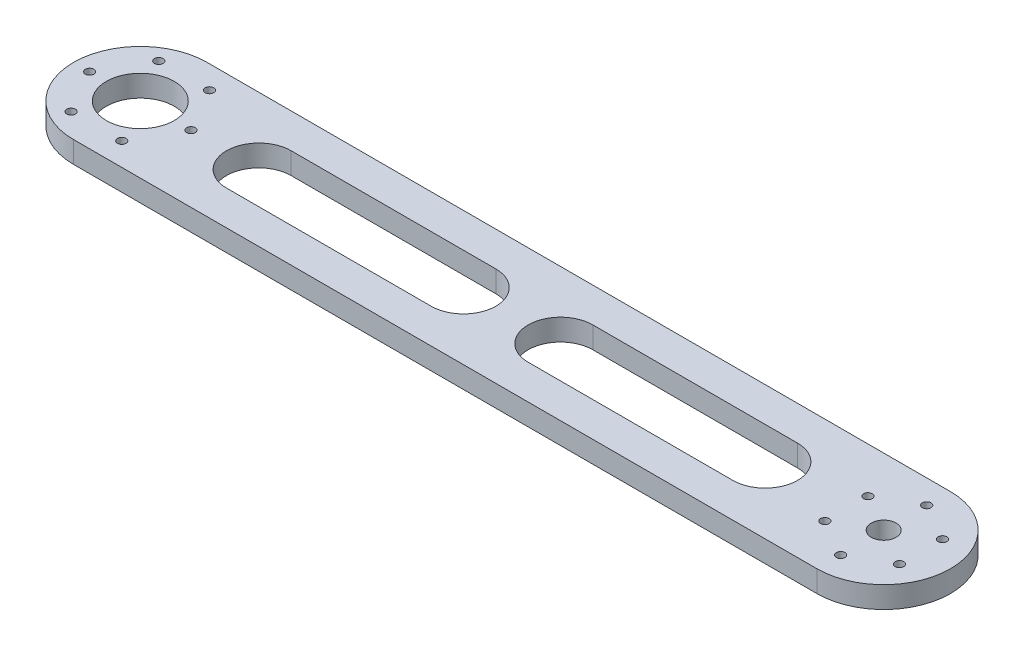
ISO-10303-21;
HEADER;
FILE_DESCRIPTION(('STEP AP214'),'2;1');
FILE_NAME('part.step','',(''),(''),'','','');
FILE_SCHEMA(('AUTOMOTIVE_DESIGN { 1 0 10303 214 1 1 1 1 }'));
ENDSEC;
DATA;
#1=APPLICATION_CONTEXT('core data for automotive mechanical design processes');
#2=APPLICATION_PROTOCOL_DEFINITION('international standard','automotive_design',2000,#1);
#3=PRODUCT_CONTEXT('',#1,'mechanical');
#4=PRODUCT('Part','Part','',(#3));
#5=PRODUCT_RELATED_PRODUCT_CATEGORY('part','',(#4));
#6=PRODUCT_DEFINITION_FORMATION('','',#4);
#7=PRODUCT_DEFINITION_CONTEXT('part definition',#1,'design');
#8=PRODUCT_DEFINITION('design','',#6,#7);
#9=PRODUCT_DEFINITION_SHAPE('','',#8);
#10=(LENGTH_UNIT() NAMED_UNIT(*) SI_UNIT(.MILLI.,.METRE.));
#11=(NAMED_UNIT(*) PLANE_ANGLE_UNIT() SI_UNIT($,.RADIAN.));
#12=(NAMED_UNIT(*) SI_UNIT($,.STERADIAN.) SOLID_ANGLE_UNIT());
#13=UNCERTAINTY_MEASURE_WITH_UNIT(LENGTH_MEASURE(1.E-05),#10,'distance_accuracy_value','');
#14=(GEOMETRIC_REPRESENTATION_CONTEXT(3) GLOBAL_UNCERTAINTY_ASSIGNED_CONTEXT((#13)) GLOBAL_UNIT_ASSIGNED_CONTEXT((#10,
#11,#12)) REPRESENTATION_CONTEXT('',''));
#15=CARTESIAN_POINT('',(0.,0.,0.));
#16=DIRECTION('',(0.,0.,1.));
#17=DIRECTION('',(1.,0.,0.));
#18=AXIS2_PLACEMENT_3D('',#15,#16,#17);
#19=CARTESIAN_POINT('',(-104.546683395043,10.,0.));
#20=DIRECTION('',(0.,1.,0.));
#21=DIRECTION('',(0.,0.,1.));
#22=AXIS2_PLACEMENT_3D('',#19,#20,#21);
#23=PLANE('',#22);
#24=CARTESIAN_POINT('',(-92.8085230633689,10.,20.3447613532394));
#25=DIRECTION('',(0.,1.,0.));
#26=DIRECTION('',(0.,0.,1.));
#27=AXIS2_PLACEMENT_3D('',#24,#25,#26);
#28=CIRCLE('',#27,1.99999999999998);
#29=CARTESIAN_POINT('',(-92.8085230633689,10.,22.3447613532394));
#30=VERTEX_POINT('',#29);
#31=EDGE_CURVE('E199',#30,#30,#28,.T.);
#32=ORIENTED_EDGE('',*,*,#31,.F.);
#33=EDGE_LOOP('',(#32));
#34=FACE_BOUND('',#33,.T.);
#35=CARTESIAN_POINT('',(-92.8085230633687,10.,-20.3447613532391));
#36=DIRECTION('',(0.,1.,0.));
#37=DIRECTION('',(0.,0.,1.));
#38=AXIS2_PLACEMENT_3D('',#35,#36,#37);
#39=CIRCLE('',#38,2.);
#40=CARTESIAN_POINT('',(-92.8085230633687,10.,-18.3447613532391));
#41=VERTEX_POINT('',#40);
#42=EDGE_CURVE('E211',#41,#41,#39,.T.);
#43=ORIENTED_EDGE('',*,*,#42,.F.);
#44=EDGE_LOOP('',(#43));
#45=FACE_BOUND('',#44,.T.);
#46=CARTESIAN_POINT('',(240.44542349274,10.,19.9863287286099));
#47=DIRECTION('',(0.,1.,0.));
#48=DIRECTION('',(0.,0.,1.));
#49=AXIS2_PLACEMENT_3D('',#46,#47,#48);
#50=CIRCLE('',#49,2.00000000000003);
#51=CARTESIAN_POINT('',(240.44542349274,10.,21.98632872861));
#52=VERTEX_POINT('',#51);
#53=EDGE_CURVE('E223',#52,#52,#50,.T.);
#54=ORIENTED_EDGE('',*,*,#53,.F.);
#55=EDGE_LOOP('',(#54));
#56=FACE_BOUND('',#55,.T.);
#57=CARTESIAN_POINT('',(257.750145343994,10.,9.98632872861002));
#58=DIRECTION('',(0.,1.,0.));
#59=DIRECTION('',(0.,0.,1.));
#60=AXIS2_PLACEMENT_3D('',#57,#58,#59);
#61=CIRCLE('',#60,2.);
#62=CARTESIAN_POINT('',(257.750145343994,10.,11.98632872861));
#63=VERTEX_POINT('',#62);
#64=EDGE_CURVE('E235',#63,#63,#61,.T.);
#65=ORIENTED_EDGE('',*,*,#64,.F.);
#66=EDGE_LOOP('',(#65));
#67=FACE_BOUND('',#66,.T.);
#68=CARTESIAN_POINT('',(240.429637268305,10.,-19.9863287286099));
#69=DIRECTION('',(0.,1.,0.));
#70=DIRECTION('',(0.,0.,1.));
#71=AXIS2_PLACEMENT_3D('',#68,#69,#70);
#72=CIRCLE('',#71,1.99999999999997);
#73=CARTESIAN_POINT('',(240.429637268305,10.,-17.98632872861));
#74=VERTEX_POINT('',#73);
#75=EDGE_CURVE('E247',#74,#74,#72,.T.);
#76=ORIENTED_EDGE('',*,*,#75,.F.);
#77=EDGE_LOOP('',(#76));
#78=FACE_BOUND('',#77,.T.);
#79=CARTESIAN_POINT('',(223.132808529268,10.,9.99999999999991));
#80=DIRECTION('',(0.,1.,0.));
#81=DIRECTION('',(0.,0.,1.));
#82=AXIS2_PLACEMENT_3D('',#79,#80,#81);
#83=CIRCLE('',#82,2.);
#84=CARTESIAN_POINT('',(223.132808529268,10.,11.9999999999999));
#85=VERTEX_POINT('',#84);
#86=EDGE_CURVE('E259',#85,#85,#83,.T.);
#87=ORIENTED_EDGE('',*,*,#86,.F.);
#88=EDGE_LOOP('',(#87));
#89=FACE_BOUND('',#88,.T.);
#90=CARTESIAN_POINT('',(-104.546683395043,10.,0.));
#91=DIRECTION('',(0.,1.,0.));
#92=DIRECTION('',(0.,0.,1.));
#93=AXIS2_PLACEMENT_3D('',#90,#91,#92);
#94=CIRCLE('',#93,15.75);
#95=CARTESIAN_POINT('',(-104.546683395043,10.,15.75));
#96=VERTEX_POINT('',#95);
#97=EDGE_CURVE('E271',#96,#96,#94,.T.);
#98=ORIENTED_EDGE('',*,*,#97,.F.);
#99=EDGE_LOOP('',(#98));
#100=FACE_BOUND('',#99,.T.);
#101=CARTESIAN_POINT('',(-104.546683395043,10.,0.));
#102=DIRECTION('',(0.,1.,0.));
#103=DIRECTION('',(0.,0.,1.));
#104=AXIS2_PLACEMENT_3D('',#101,#102,#103);
#105=CIRCLE('',#104,31.);
#106=CARTESIAN_POINT('',(-104.546683395043,10.,-31.));
#107=VERTEX_POINT('',#106);
#108=CARTESIAN_POINT('',(-104.546683395043,10.,31.));
#109=VERTEX_POINT('',#108);
#110=EDGE_CURVE('E277',#107,#109,#105,.T.);
#111=ORIENTED_EDGE('',*,*,#110,.T.);
#112=DIRECTION('',(1.,0.,0.));
#113=VECTOR('',#112,1.);
#114=CARTESIAN_POINT('',(-104.546683395043,10.,31.));
#115=LINE('',#114,#113);
#116=CARTESIAN_POINT('',(240.453316604957,10.,31.));
#117=VERTEX_POINT('',#116);
#118=EDGE_CURVE('E280',#109,#117,#115,.T.);
#119=ORIENTED_EDGE('',*,*,#118,.T.);
#120=CARTESIAN_POINT('',(240.453316604957,10.,0.));
#121=DIRECTION('',(0.,1.,0.));
#122=DIRECTION('',(0.,0.,1.));
#123=AXIS2_PLACEMENT_3D('',#120,#121,#122);
#124=CIRCLE('',#123,31.);
#125=CARTESIAN_POINT('',(240.453316604957,10.,-31.));
#126=VERTEX_POINT('',#125);
#127=EDGE_CURVE('E283',#117,#126,#124,.T.);
#128=ORIENTED_EDGE('',*,*,#127,.T.);
#129=DIRECTION('',(-1.,0.,0.));
#130=VECTOR('',#129,1.);
#131=CARTESIAN_POINT('',(-104.546683395043,10.,-31.));
#132=LINE('',#131,#130);
#133=EDGE_CURVE('E285',#126,#107,#132,.T.);
#134=ORIENTED_EDGE('',*,*,#133,.T.);
#135=EDGE_LOOP('',(#111,#119,#128,#134));
#136=FACE_BOUND('',#135,.T.);
#137=CARTESIAN_POINT('',(240.453316604957,10.,0.));
#138=DIRECTION('',(0.,1.,0.));
#139=DIRECTION('',(0.,0.,1.));
#140=AXIS2_PLACEMENT_3D('',#137,#138,#139);
#141=CIRCLE('',#140,5.75);
#142=CARTESIAN_POINT('',(240.453316604957,10.,5.75));
#143=VERTEX_POINT('',#142);
#144=EDGE_CURVE('E265',#143,#143,#141,.T.);
#145=ORIENTED_EDGE('',*,*,#144,.F.);
#146=EDGE_LOOP('',(#145));
#147=FACE_BOUND('',#146,.T.);
#148=CARTESIAN_POINT('',(223.124915417051,10.,-9.98632872861002));
#149=DIRECTION('',(0.,1.,0.));
#150=DIRECTION('',(0.,0.,1.));
#151=AXIS2_PLACEMENT_3D('',#148,#149,#150);
#152=CIRCLE('',#151,2.00000000000003);
#153=CARTESIAN_POINT('',(223.124915417051,10.,-7.98632872861));
#154=VERTEX_POINT('',#153);
#155=EDGE_CURVE('E253',#154,#154,#152,.T.);
#156=ORIENTED_EDGE('',*,*,#155,.F.);
#157=EDGE_LOOP('',(#156));
#158=FACE_BOUND('',#157,.T.);
#159=CARTESIAN_POINT('',(257.742252231777,10.,-9.9999999999999));
#160=DIRECTION('',(0.,1.,0.));
#161=DIRECTION('',(0.,0.,1.));
#162=AXIS2_PLACEMENT_3D('',#159,#160,#161);
#163=CIRCLE('',#162,2.00000000000005);
#164=CARTESIAN_POINT('',(257.742252231777,10.,-7.99999999999985));
#165=VERTEX_POINT('',#164);
#166=EDGE_CURVE('E241',#165,#165,#163,.T.);
#167=ORIENTED_EDGE('',*,*,#166,.F.);
#168=EDGE_LOOP('',(#167));
#169=FACE_BOUND('',#168,.T.);
#170=CARTESIAN_POINT('',(-128.046683395043,10.,0.));
#171=DIRECTION('',(0.,1.,0.));
#172=DIRECTION('',(0.,0.,1.));
#173=AXIS2_PLACEMENT_3D('',#170,#171,#172);
#174=CIRCLE('',#173,2.);
#175=CARTESIAN_POINT('',(-128.046683395043,10.,2.));
#176=VERTEX_POINT('',#175);
#177=EDGE_CURVE('E229',#176,#176,#174,.T.);
#178=ORIENTED_EDGE('',*,*,#177,.F.);
#179=EDGE_LOOP('',(#178));
#180=FACE_BOUND('',#179,.T.);
#181=CARTESIAN_POINT('',(-116.300629951151,10.,-20.3447613532392));
#182=DIRECTION('',(0.,1.,0.));
#183=DIRECTION('',(0.,0.,1.));
#184=AXIS2_PLACEMENT_3D('',#181,#182,#183);
#185=CIRCLE('',#184,2.);
#186=CARTESIAN_POINT('',(-116.300629951151,10.,-18.3447613532392));
#187=VERTEX_POINT('',#186);
#188=EDGE_CURVE('E217',#187,#187,#185,.T.);
#189=ORIENTED_EDGE('',*,*,#188,.F.);
#190=EDGE_LOOP('',(#189));
#191=FACE_BOUND('',#190,.T.);
#192=CARTESIAN_POINT('',(-81.0624696194774,10.,1.64099622925627E-13));
#193=DIRECTION('',(0.,1.,0.));
#194=DIRECTION('',(0.,0.,1.));
#195=AXIS2_PLACEMENT_3D('',#192,#193,#194);
#196=CIRCLE('',#195,1.99999999999999);
#197=CARTESIAN_POINT('',(-81.0624696194774,10.,2.00000000000016));
#198=VERTEX_POINT('',#197);
#199=EDGE_CURVE('E205',#198,#198,#196,.T.);
#200=ORIENTED_EDGE('',*,*,#199,.F.);
#201=EDGE_LOOP('',(#200));
#202=FACE_BOUND('',#201,.T.);
#203=CARTESIAN_POINT('',(-116.300629951152,10.,20.3447613532393));
#204=DIRECTION('',(0.,1.,0.));
#205=DIRECTION('',(0.,0.,1.));
#206=AXIS2_PLACEMENT_3D('',#203,#204,#205);
#207=CIRCLE('',#206,1.99999999999998);
#208=CARTESIAN_POINT('',(-116.300629951152,10.,22.3447613532393));
#209=VERTEX_POINT('',#208);
#210=EDGE_CURVE('E193',#209,#209,#207,.T.);
#211=ORIENTED_EDGE('',*,*,#210,.F.);
#212=EDGE_LOOP('',(#211));
#213=FACE_BOUND('',#212,.T.);
#214=DIRECTION('',(1.,0.,0.));
#215=VECTOR('',#214,1.);
#216=CARTESIAN_POINT('',(-49.5466833950429,10.,15.));
#217=LINE('',#216,#215);
#218=CARTESIAN_POINT('',(-49.5466833950429,10.,15.));
#219=VERTEX_POINT('',#218);
#220=CARTESIAN_POINT('',(45.4533166049571,10.,15.));
#221=VERTEX_POINT('',#220);
#222=EDGE_CURVE('E164',#219,#221,#217,.T.);
#223=ORIENTED_EDGE('',*,*,#222,.F.);
#224=CARTESIAN_POINT('',(-49.5466833950429,10.,0.));
#225=DIRECTION('',(0.,1.,0.));
#226=DIRECTION('',(0.,0.,1.));
#227=AXIS2_PLACEMENT_3D('',#224,#225,#226);
#228=CIRCLE('',#227,15.);
#229=CARTESIAN_POINT('',(-49.5466833950429,10.,-15.));
#230=VERTEX_POINT('',#229);
#231=EDGE_CURVE('E162',#230,#219,#228,.T.);
#232=ORIENTED_EDGE('',*,*,#231,.F.);
#233=DIRECTION('',(-1.,0.,0.));
#234=VECTOR('',#233,1.);
#235=CARTESIAN_POINT('',(-49.5466833950429,10.,-15.));
#236=LINE('',#235,#234);
#237=CARTESIAN_POINT('',(45.4533166049571,10.,-15.));
#238=VERTEX_POINT('',#237);
#239=EDGE_CURVE('E170',#238,#230,#236,.T.);
#240=ORIENTED_EDGE('',*,*,#239,.F.);
#241=CARTESIAN_POINT('',(45.4533166049571,10.,0.));
#242=DIRECTION('',(0.,1.,0.));
#243=DIRECTION('',(0.,0.,1.));
#244=AXIS2_PLACEMENT_3D('',#241,#242,#243);
#245=CIRCLE('',#244,15.);
#246=EDGE_CURVE('E167',#221,#238,#245,.T.);
#247=ORIENTED_EDGE('',*,*,#246,.F.);
#248=EDGE_LOOP('',(#223,#232,#240,#247));
#249=FACE_BOUND('',#248,.T.);
#250=DIRECTION('',(1.,0.,0.));
#251=VECTOR('',#250,1.);
#252=CARTESIAN_POINT('',(90.4533166049571,10.,15.));
#253=LINE('',#252,#251);
#254=CARTESIAN_POINT('',(90.4533166049571,10.,15.));
#255=VERTEX_POINT('',#254);
#256=CARTESIAN_POINT('',(185.453316604957,10.,15.));
#257=VERTEX_POINT('',#256);
#258=EDGE_CURVE('E134',#255,#257,#253,.T.);
#259=ORIENTED_EDGE('',*,*,#258,.F.);
#260=CARTESIAN_POINT('',(90.4533166049571,10.,0.));
#261=DIRECTION('',(0.,1.,0.));
#262=DIRECTION('',(0.,0.,1.));
#263=AXIS2_PLACEMENT_3D('',#260,#261,#262);
#264=CIRCLE('',#263,15.);
#265=CARTESIAN_POINT('',(90.4533166049571,10.,-15.));
#266=VERTEX_POINT('',#265);
#267=EDGE_CURVE('E126',#266,#255,#264,.T.);
#268=ORIENTED_EDGE('',*,*,#267,.F.);
#269=DIRECTION('',(-1.,0.,0.));
#270=VECTOR('',#269,1.);
#271=CARTESIAN_POINT('',(90.4533166049571,10.,-15.));
#272=LINE('',#271,#270);
#273=CARTESIAN_POINT('',(185.453316604957,10.,-15.));
#274=VERTEX_POINT('',#273);
#275=EDGE_CURVE('E148',#274,#266,#272,.T.);
#276=ORIENTED_EDGE('',*,*,#275,.F.);
#277=CARTESIAN_POINT('',(185.453316604957,10.,0.));
#278=DIRECTION('',(0.,1.,0.));
#279=DIRECTION('',(0.,0.,1.));
#280=AXIS2_PLACEMENT_3D('',#277,#278,#279);
#281=CIRCLE('',#280,15.);
#282=EDGE_CURVE('E146',#257,#274,#281,.T.);
#283=ORIENTED_EDGE('',*,*,#282,.F.);
#284=EDGE_LOOP('',(#259,#268,#276,#283));
#285=FACE_BOUND('',#284,.T.);
#286=ADVANCED_FACE('F37',(#34,#45,#56,#67,#78,#89,#100,#136,#147,#158,#169,#180,#191,#202,#213,
#249,#285),#23,.T.);
#287=CARTESIAN_POINT('',(-104.546683395043,0.,0.));
#288=DIRECTION('',(0.,1.,0.));
#289=DIRECTION('',(0.,0.,1.));
#290=AXIS2_PLACEMENT_3D('',#287,#288,#289);
#291=PLANE('',#290);
#292=CARTESIAN_POINT('',(-49.5466833950429,0.,0.));
#293=DIRECTION('',(0.,1.,0.));
#294=DIRECTION('',(0.,0.,1.));
#295=AXIS2_PLACEMENT_3D('',#292,#293,#294);
#296=CIRCLE('',#295,15.);
#297=CARTESIAN_POINT('',(-49.5466833950429,0.,-15.));
#298=VERTEX_POINT('',#297);
#299=CARTESIAN_POINT('',(-49.5466833950429,0.,15.));
#300=VERTEX_POINT('',#299);
#301=EDGE_CURVE('E142',#298,#300,#296,.T.);
#302=ORIENTED_EDGE('',*,*,#301,.T.);
#303=DIRECTION('',(1.,0.,0.));
#304=VECTOR('',#303,1.);
#305=CARTESIAN_POINT('',(-49.5466833950429,0.,15.));
#306=LINE('',#305,#304);
#307=CARTESIAN_POINT('',(45.4533166049571,0.,15.));
#308=VERTEX_POINT('',#307);
#309=EDGE_CURVE('E175',#300,#308,#306,.T.);
#310=ORIENTED_EDGE('',*,*,#309,.T.);
#311=CARTESIAN_POINT('',(45.4533166049571,0.,0.));
#312=DIRECTION('',(0.,1.,0.));
#313=DIRECTION('',(0.,0.,1.));
#314=AXIS2_PLACEMENT_3D('',#311,#312,#313);
#315=CIRCLE('',#314,15.);
#316=CARTESIAN_POINT('',(45.4533166049571,0.,-15.));
#317=VERTEX_POINT('',#316);
#318=EDGE_CURVE('E178',#308,#317,#315,.T.);
#319=ORIENTED_EDGE('',*,*,#318,.T.);
#320=DIRECTION('',(-1.,0.,0.));
#321=VECTOR('',#320,1.);
#322=CARTESIAN_POINT('',(-49.5466833950429,0.,-15.));
#323=LINE('',#322,#321);
#324=EDGE_CURVE('E165',#317,#298,#323,.T.);
#325=ORIENTED_EDGE('',*,*,#324,.T.);
#326=EDGE_LOOP('',(#302,#310,#319,#325));
#327=FACE_BOUND('',#326,.T.);
#328=CARTESIAN_POINT('',(-104.546683395043,0.,0.));
#329=DIRECTION('',(0.,1.,0.));
#330=DIRECTION('',(0.,0.,1.));
#331=AXIS2_PLACEMENT_3D('',#328,#329,#330);
#332=CIRCLE('',#331,31.);
#333=CARTESIAN_POINT('',(-104.546683395043,0.,-31.));
#334=VERTEX_POINT('',#333);
#335=CARTESIAN_POINT('',(-104.546683395043,0.,31.));
#336=VERTEX_POINT('',#335);
#337=EDGE_CURVE('E274',#334,#336,#332,.T.);
#338=ORIENTED_EDGE('',*,*,#337,.F.);
#339=DIRECTION('',(-1.,0.,0.));
#340=VECTOR('',#339,1.);
#341=CARTESIAN_POINT('',(-104.546683395043,0.,-31.));
#342=LINE('',#341,#340);
#343=CARTESIAN_POINT('',(240.453316604957,0.,-31.));
#344=VERTEX_POINT('',#343);
#345=EDGE_CURVE('E281',#344,#334,#342,.T.);
#346=ORIENTED_EDGE('',*,*,#345,.F.);
#347=CARTESIAN_POINT('',(240.453316604957,0.,0.));
#348=DIRECTION('',(0.,1.,0.));
#349=DIRECTION('',(0.,0.,1.));
#350=AXIS2_PLACEMENT_3D('',#347,#348,#349);
#351=CIRCLE('',#350,31.);
#352=CARTESIAN_POINT('',(240.453316604957,0.,31.));
#353=VERTEX_POINT('',#352);
#354=EDGE_CURVE('E292',#353,#344,#351,.T.);
#355=ORIENTED_EDGE('',*,*,#354,.F.);
#356=DIRECTION('',(1.,0.,0.));
#357=VECTOR('',#356,1.);
#358=CARTESIAN_POINT('',(-104.546683395043,0.,31.));
#359=LINE('',#358,#357);
#360=EDGE_CURVE('E290',#336,#353,#359,.T.);
#361=ORIENTED_EDGE('',*,*,#360,.F.);
#362=EDGE_LOOP('',(#338,#346,#355,#361));
#363=FACE_BOUND('',#362,.T.);
#364=CARTESIAN_POINT('',(-104.546683395043,0.,0.));
#365=DIRECTION('',(0.,1.,0.));
#366=DIRECTION('',(0.,0.,1.));
#367=AXIS2_PLACEMENT_3D('',#364,#365,#366);
#368=CIRCLE('',#367,15.75);
#369=CARTESIAN_POINT('',(-104.546683395043,0.,15.75));
#370=VERTEX_POINT('',#369);
#371=EDGE_CURVE('E268',#370,#370,#368,.T.);
#372=ORIENTED_EDGE('',*,*,#371,.T.);
#373=EDGE_LOOP('',(#372));
#374=FACE_BOUND('',#373,.T.);
#375=CARTESIAN_POINT('',(240.453316604957,0.,0.));
#376=DIRECTION('',(0.,1.,0.));
#377=DIRECTION('',(0.,0.,1.));
#378=AXIS2_PLACEMENT_3D('',#375,#376,#377);
#379=CIRCLE('',#378,5.75);
#380=CARTESIAN_POINT('',(240.453316604957,0.,5.75));
#381=VERTEX_POINT('',#380);
#382=EDGE_CURVE('E262',#381,#381,#379,.T.);
#383=ORIENTED_EDGE('',*,*,#382,.T.);
#384=EDGE_LOOP('',(#383));
#385=FACE_BOUND('',#384,.T.);
#386=CARTESIAN_POINT('',(223.132808529268,0.,9.99999999999991));
#387=DIRECTION('',(0.,1.,0.));
#388=DIRECTION('',(0.,0.,1.));
#389=AXIS2_PLACEMENT_3D('',#386,#387,#388);
#390=CIRCLE('',#389,2.);
#391=CARTESIAN_POINT('',(223.132808529268,0.,11.9999999999999));
#392=VERTEX_POINT('',#391);
#393=EDGE_CURVE('E256',#392,#392,#390,.T.);
#394=ORIENTED_EDGE('',*,*,#393,.T.);
#395=EDGE_LOOP('',(#394));
#396=FACE_BOUND('',#395,.T.);
#397=CARTESIAN_POINT('',(223.124915417051,0.,-9.98632872861002));
#398=DIRECTION('',(0.,1.,0.));
#399=DIRECTION('',(0.,0.,1.));
#400=AXIS2_PLACEMENT_3D('',#397,#398,#399);
#401=CIRCLE('',#400,2.00000000000003);
#402=CARTESIAN_POINT('',(223.124915417051,0.,-7.98632872861));
#403=VERTEX_POINT('',#402);
#404=EDGE_CURVE('E250',#403,#403,#401,.T.);
#405=ORIENTED_EDGE('',*,*,#404,.T.);
#406=EDGE_LOOP('',(#405));
#407=FACE_BOUND('',#406,.T.);
#408=CARTESIAN_POINT('',(240.429637268305,0.,-19.9863287286099));
#409=DIRECTION('',(0.,1.,0.));
#410=DIRECTION('',(0.,0.,1.));
#411=AXIS2_PLACEMENT_3D('',#408,#409,#410);
#412=CIRCLE('',#411,1.99999999999997);
#413=CARTESIAN_POINT('',(240.429637268305,0.,-17.98632872861));
#414=VERTEX_POINT('',#413);
#415=EDGE_CURVE('E244',#414,#414,#412,.T.);
#416=ORIENTED_EDGE('',*,*,#415,.T.);
#417=EDGE_LOOP('',(#416));
#418=FACE_BOUND('',#417,.T.);
#419=CARTESIAN_POINT('',(257.742252231777,0.,-9.9999999999999));
#420=DIRECTION('',(0.,1.,0.));
#421=DIRECTION('',(0.,0.,1.));
#422=AXIS2_PLACEMENT_3D('',#419,#420,#421);
#423=CIRCLE('',#422,2.00000000000005);
#424=CARTESIAN_POINT('',(257.742252231777,0.,-7.99999999999985));
#425=VERTEX_POINT('',#424);
#426=EDGE_CURVE('E238',#425,#425,#423,.T.);
#427=ORIENTED_EDGE('',*,*,#426,.T.);
#428=EDGE_LOOP('',(#427));
#429=FACE_BOUND('',#428,.T.);
#430=CARTESIAN_POINT('',(257.750145343994,0.,9.98632872861002));
#431=DIRECTION('',(0.,1.,0.));
#432=DIRECTION('',(0.,0.,1.));
#433=AXIS2_PLACEMENT_3D('',#430,#431,#432);
#434=CIRCLE('',#433,2.);
#435=CARTESIAN_POINT('',(257.750145343994,0.,11.98632872861));
#436=VERTEX_POINT('',#435);
#437=EDGE_CURVE('E232',#436,#436,#434,.T.);
#438=ORIENTED_EDGE('',*,*,#437,.T.);
#439=EDGE_LOOP('',(#438));
#440=FACE_BOUND('',#439,.T.);
#441=CARTESIAN_POINT('',(-128.046683395043,0.,0.));
#442=DIRECTION('',(0.,1.,0.));
#443=DIRECTION('',(0.,0.,1.));
#444=AXIS2_PLACEMENT_3D('',#441,#442,#443);
#445=CIRCLE('',#444,2.);
#446=CARTESIAN_POINT('',(-128.046683395043,0.,2.));
#447=VERTEX_POINT('',#446);
#448=EDGE_CURVE('E226',#447,#447,#445,.T.);
#449=ORIENTED_EDGE('',*,*,#448,.T.);
#450=EDGE_LOOP('',(#449));
#451=FACE_BOUND('',#450,.T.);
#452=CARTESIAN_POINT('',(240.44542349274,0.,19.9863287286099));
#453=DIRECTION('',(0.,1.,0.));
#454=DIRECTION('',(0.,0.,1.));
#455=AXIS2_PLACEMENT_3D('',#452,#453,#454);
#456=CIRCLE('',#455,2.00000000000003);
#457=CARTESIAN_POINT('',(240.44542349274,0.,21.98632872861));
#458=VERTEX_POINT('',#457);
#459=EDGE_CURVE('E220',#458,#458,#456,.T.);
#460=ORIENTED_EDGE('',*,*,#459,.T.);
#461=EDGE_LOOP('',(#460));
#462=FACE_BOUND('',#461,.T.);
#463=CARTESIAN_POINT('',(-116.300629951151,0.,-20.3447613532392));
#464=DIRECTION('',(0.,1.,0.));
#465=DIRECTION('',(0.,0.,1.));
#466=AXIS2_PLACEMENT_3D('',#463,#464,#465);
#467=CIRCLE('',#466,2.);
#468=CARTESIAN_POINT('',(-116.300629951151,0.,-18.3447613532392));
#469=VERTEX_POINT('',#468);
#470=EDGE_CURVE('E214',#469,#469,#467,.T.);
#471=ORIENTED_EDGE('',*,*,#470,.T.);
#472=EDGE_LOOP('',(#471));
#473=FACE_BOUND('',#472,.T.);
#474=CARTESIAN_POINT('',(-92.8085230633687,0.,-20.3447613532391));
#475=DIRECTION('',(0.,1.,0.));
#476=DIRECTION('',(0.,0.,1.));
#477=AXIS2_PLACEMENT_3D('',#474,#475,#476);
#478=CIRCLE('',#477,2.);
#479=CARTESIAN_POINT('',(-92.8085230633687,0.,-18.3447613532391));
#480=VERTEX_POINT('',#479);
#481=EDGE_CURVE('E208',#480,#480,#478,.T.);
#482=ORIENTED_EDGE('',*,*,#481,.T.);
#483=EDGE_LOOP('',(#482));
#484=FACE_BOUND('',#483,.T.);
#485=CARTESIAN_POINT('',(-81.0624696194774,0.,1.64099622925627E-13));
#486=DIRECTION('',(0.,1.,0.));
#487=DIRECTION('',(0.,0.,1.));
#488=AXIS2_PLACEMENT_3D('',#485,#486,#487);
#489=CIRCLE('',#488,1.99999999999999);
#490=CARTESIAN_POINT('',(-81.0624696194774,0.,2.00000000000016));
#491=VERTEX_POINT('',#490);
#492=EDGE_CURVE('E202',#491,#491,#489,.T.);
#493=ORIENTED_EDGE('',*,*,#492,.T.);
#494=EDGE_LOOP('',(#493));
#495=FACE_BOUND('',#494,.T.);
#496=CARTESIAN_POINT('',(-92.8085230633689,0.,20.3447613532394));
#497=DIRECTION('',(0.,1.,0.));
#498=DIRECTION('',(0.,0.,1.));
#499=AXIS2_PLACEMENT_3D('',#496,#497,#498);
#500=CIRCLE('',#499,1.99999999999998);
#501=CARTESIAN_POINT('',(-92.8085230633689,0.,22.3447613532394));
#502=VERTEX_POINT('',#501);
#503=EDGE_CURVE('E196',#502,#502,#500,.T.);
#504=ORIENTED_EDGE('',*,*,#503,.T.);
#505=EDGE_LOOP('',(#504));
#506=FACE_BOUND('',#505,.T.);
#507=CARTESIAN_POINT('',(-116.300629951152,0.,20.3447613532393));
#508=DIRECTION('',(0.,1.,0.));
#509=DIRECTION('',(0.,0.,1.));
#510=AXIS2_PLACEMENT_3D('',#507,#508,#509);
#511=CIRCLE('',#510,1.99999999999998);
#512=CARTESIAN_POINT('',(-116.300629951152,0.,22.3447613532393));
#513=VERTEX_POINT('',#512);
#514=EDGE_CURVE('E192',#513,#513,#511,.T.);
#515=ORIENTED_EDGE('',*,*,#514,.T.);
#516=EDGE_LOOP('',(#515));
#517=FACE_BOUND('',#516,.T.);
#518=CARTESIAN_POINT('',(90.4533166049571,0.,0.));
#519=DIRECTION('',(0.,1.,0.));
#520=DIRECTION('',(0.,0.,1.));
#521=AXIS2_PLACEMENT_3D('',#518,#519,#520);
#522=CIRCLE('',#521,15.);
#523=CARTESIAN_POINT('',(90.4533166049571,0.,-15.));
#524=VERTEX_POINT('',#523);
#525=CARTESIAN_POINT('',(90.4533166049571,0.,15.));
#526=VERTEX_POINT('',#525);
#527=EDGE_CURVE('E60',#524,#526,#522,.T.);
#528=ORIENTED_EDGE('',*,*,#527,.T.);
#529=DIRECTION('',(1.,0.,0.));
#530=VECTOR('',#529,1.);
#531=CARTESIAN_POINT('',(90.4533166049571,0.,15.));
#532=LINE('',#531,#530);
#533=CARTESIAN_POINT('',(185.453316604957,0.,15.));
#534=VERTEX_POINT('',#533);
#535=EDGE_CURVE('E141',#526,#534,#532,.T.);
#536=ORIENTED_EDGE('',*,*,#535,.T.);
#537=CARTESIAN_POINT('',(185.453316604957,0.,0.));
#538=DIRECTION('',(0.,1.,0.));
#539=DIRECTION('',(0.,0.,1.));
#540=AXIS2_PLACEMENT_3D('',#537,#538,#539);
#541=CIRCLE('',#540,15.);
#542=CARTESIAN_POINT('',(185.453316604957,0.,-15.));
#543=VERTEX_POINT('',#542);
#544=EDGE_CURVE('E154',#534,#543,#541,.T.);
#545=ORIENTED_EDGE('',*,*,#544,.T.);
#546=DIRECTION('',(-1.,0.,0.));
#547=VECTOR('',#546,1.);
#548=CARTESIAN_POINT('',(90.4533166049571,0.,-15.));
#549=LINE('',#548,#547);
#550=EDGE_CURVE('E135',#543,#524,#549,.T.);
#551=ORIENTED_EDGE('',*,*,#550,.T.);
#552=EDGE_LOOP('',(#528,#536,#545,#551));
#553=FACE_BOUND('',#552,.T.);
#554=ADVANCED_FACE('F310',(#327,#363,#374,#385,#396,#407,#418,#429,#440,#451,#462,#473,#484,
#495,#506,#517,#553),#291,.F.);
#555=CARTESIAN_POINT('',(-104.546683395043,10.,0.));
#556=DIRECTION('',(0.,-1.,0.));
#557=DIRECTION('',(0.,0.,-1.));
#558=AXIS2_PLACEMENT_3D('',#555,#556,#557);
#559=CYLINDRICAL_SURFACE('',#558,31.);
#560=ORIENTED_EDGE('',*,*,#337,.T.);
#561=DIRECTION('',(0.,-1.,0.));
#562=VECTOR('',#561,1.);
#563=CARTESIAN_POINT('',(-104.546683395043,10.,31.));
#564=LINE('',#563,#562);
#565=EDGE_CURVE('E11',#109,#336,#564,.T.);
#566=ORIENTED_EDGE('',*,*,#565,.F.);
#567=ORIENTED_EDGE('',*,*,#110,.F.);
#568=DIRECTION('',(0.,-1.,0.));
#569=VECTOR('',#568,1.);
#570=CARTESIAN_POINT('',(-104.546683395043,10.,-31.));
#571=LINE('',#570,#569);
#572=EDGE_CURVE('E287',#107,#334,#571,.T.);
#573=ORIENTED_EDGE('',*,*,#572,.T.);
#574=EDGE_LOOP('',(#560,#566,#567,#573));
#575=FACE_BOUND('',#574,.T.);
#576=ADVANCED_FACE('F39',(#575),#559,.T.);
#577=CARTESIAN_POINT('',(-104.546683395043,10.,31.));
#578=DIRECTION('',(0.,0.,-1.));
#579=DIRECTION('',(-1.,0.,0.));
#580=AXIS2_PLACEMENT_3D('',#577,#578,#579);
#581=PLANE('',#580);
#582=ORIENTED_EDGE('',*,*,#360,.T.);
#583=DIRECTION('',(0.,-1.,0.));
#584=VECTOR('',#583,1.);
#585=CARTESIAN_POINT('',(240.453316604957,10.,31.));
#586=LINE('',#585,#584);
#587=EDGE_CURVE('E45',#117,#353,#586,.T.);
#588=ORIENTED_EDGE('',*,*,#587,.F.);
#589=ORIENTED_EDGE('',*,*,#118,.F.);
#590=ORIENTED_EDGE('',*,*,#565,.T.);
#591=EDGE_LOOP('',(#582,#588,#589,#590));
#592=FACE_BOUND('',#591,.T.);
#593=ADVANCED_FACE('F321',(#592),#581,.F.);
#594=CARTESIAN_POINT('',(240.453316604957,10.,0.));
#595=DIRECTION('',(0.,-1.,0.));
#596=DIRECTION('',(0.,0.,-1.));
#597=AXIS2_PLACEMENT_3D('',#594,#595,#596);
#598=CYLINDRICAL_SURFACE('',#597,31.);
#599=ORIENTED_EDGE('',*,*,#354,.T.);
#600=DIRECTION('',(0.,-1.,0.));
#601=VECTOR('',#600,1.);
#602=CARTESIAN_POINT('',(240.453316604957,10.,-31.));
#603=LINE('',#602,#601);
#604=EDGE_CURVE('E297',#126,#344,#603,.T.);
#605=ORIENTED_EDGE('',*,*,#604,.F.);
#606=ORIENTED_EDGE('',*,*,#127,.F.);
#607=ORIENTED_EDGE('',*,*,#587,.T.);
#608=EDGE_LOOP('',(#599,#605,#606,#607));
#609=FACE_BOUND('',#608,.T.);
#610=ADVANCED_FACE('F304',(#609),#598,.T.);
#611=CARTESIAN_POINT('',(-104.546683395043,10.,-31.));
#612=DIRECTION('',(0.,0.,1.));
#613=DIRECTION('',(1.,0.,0.));
#614=AXIS2_PLACEMENT_3D('',#611,#612,#613);
#615=PLANE('',#614);
#616=ORIENTED_EDGE('',*,*,#345,.T.);
#617=ORIENTED_EDGE('',*,*,#572,.F.);
#618=ORIENTED_EDGE('',*,*,#133,.F.);
#619=ORIENTED_EDGE('',*,*,#604,.T.);
#620=EDGE_LOOP('',(#616,#617,#618,#619));
#621=FACE_BOUND('',#620,.T.);
#622=ADVANCED_FACE('F314',(#621),#615,.F.);
#623=CARTESIAN_POINT('',(-104.546683395043,10.,0.));
#624=DIRECTION('',(0.,-1.,0.));
#625=DIRECTION('',(0.,0.,-1.));
#626=AXIS2_PLACEMENT_3D('',#623,#624,#625);
#627=CYLINDRICAL_SURFACE('',#626,15.75);
#628=ORIENTED_EDGE('',*,*,#97,.T.);
#629=EDGE_LOOP('',(#628));
#630=FACE_BOUND('',#629,.T.);
#631=ORIENTED_EDGE('',*,*,#371,.F.);
#632=EDGE_LOOP('',(#631));
#633=FACE_BOUND('',#632,.T.);
#634=ADVANCED_FACE('F339',(#630,#633),#627,.F.);
#635=CARTESIAN_POINT('',(240.453316604957,10.,0.));
#636=DIRECTION('',(0.,-1.,0.));
#637=DIRECTION('',(0.,0.,-1.));
#638=AXIS2_PLACEMENT_3D('',#635,#636,#637);
#639=CYLINDRICAL_SURFACE('',#638,5.75);
#640=ORIENTED_EDGE('',*,*,#144,.T.);
#641=EDGE_LOOP('',(#640));
#642=FACE_BOUND('',#641,.T.);
#643=ORIENTED_EDGE('',*,*,#382,.F.);
#644=EDGE_LOOP('',(#643));
#645=FACE_BOUND('',#644,.T.);
#646=ADVANCED_FACE('F346',(#642,#645),#639,.F.);
#647=CARTESIAN_POINT('',(223.132808529268,10.,9.99999999999991));
#648=DIRECTION('',(0.,-1.,0.));
#649=DIRECTION('',(0.,0.,-1.));
#650=AXIS2_PLACEMENT_3D('',#647,#648,#649);
#651=CYLINDRICAL_SURFACE('',#650,2.);
#652=ORIENTED_EDGE('',*,*,#86,.T.);
#653=EDGE_LOOP('',(#652));
#654=FACE_BOUND('',#653,.T.);
#655=ORIENTED_EDGE('',*,*,#393,.F.);
#656=EDGE_LOOP('',(#655));
#657=FACE_BOUND('',#656,.T.);
#658=ADVANCED_FACE('F351',(#654,#657),#651,.F.);
#659=CARTESIAN_POINT('',(223.124915417051,10.,-9.98632872861002));
#660=DIRECTION('',(0.,-1.,0.));
#661=DIRECTION('',(0.,0.,-1.));
#662=AXIS2_PLACEMENT_3D('',#659,#660,#661);
#663=CYLINDRICAL_SURFACE('',#662,2.00000000000003);
#664=ORIENTED_EDGE('',*,*,#155,.T.);
#665=EDGE_LOOP('',(#664));
#666=FACE_BOUND('',#665,.T.);
#667=ORIENTED_EDGE('',*,*,#404,.F.);
#668=EDGE_LOOP('',(#667));
#669=FACE_BOUND('',#668,.T.);
#670=ADVANCED_FACE('F453',(#666,#669),#663,.F.);
#671=CARTESIAN_POINT('',(240.429637268305,10.,-19.9863287286099));
#672=DIRECTION('',(0.,-1.,0.));
#673=DIRECTION('',(0.,0.,-1.));
#674=AXIS2_PLACEMENT_3D('',#671,#672,#673);
#675=CYLINDRICAL_SURFACE('',#674,1.99999999999997);
#676=ORIENTED_EDGE('',*,*,#75,.T.);
#677=EDGE_LOOP('',(#676));
#678=FACE_BOUND('',#677,.T.);
#679=ORIENTED_EDGE('',*,*,#415,.F.);
#680=EDGE_LOOP('',(#679));
#681=FACE_BOUND('',#680,.T.);
#682=ADVANCED_FACE('F449',(#678,#681),#675,.F.);
#683=CARTESIAN_POINT('',(257.742252231777,10.,-9.9999999999999));
#684=DIRECTION('',(0.,-1.,0.));
#685=DIRECTION('',(0.,0.,-1.));
#686=AXIS2_PLACEMENT_3D('',#683,#684,#685);
#687=CYLINDRICAL_SURFACE('',#686,2.00000000000005);
#688=ORIENTED_EDGE('',*,*,#166,.T.);
#689=EDGE_LOOP('',(#688));
#690=FACE_BOUND('',#689,.T.);
#691=ORIENTED_EDGE('',*,*,#426,.F.);
#692=EDGE_LOOP('',(#691));
#693=FACE_BOUND('',#692,.T.);
#694=ADVANCED_FACE('F445',(#690,#693),#687,.F.);
#695=CARTESIAN_POINT('',(257.750145343994,10.,9.98632872861002));
#696=DIRECTION('',(0.,-1.,0.));
#697=DIRECTION('',(0.,0.,-1.));
#698=AXIS2_PLACEMENT_3D('',#695,#696,#697);
#699=CYLINDRICAL_SURFACE('',#698,2.);
#700=ORIENTED_EDGE('',*,*,#64,.T.);
#701=EDGE_LOOP('',(#700));
#702=FACE_BOUND('',#701,.T.);
#703=ORIENTED_EDGE('',*,*,#437,.F.);
#704=EDGE_LOOP('',(#703));
#705=FACE_BOUND('',#704,.T.);
#706=ADVANCED_FACE('F441',(#702,#705),#699,.F.);
#707=CARTESIAN_POINT('',(-128.046683395043,10.,0.));
#708=DIRECTION('',(0.,-1.,0.));
#709=DIRECTION('',(0.,0.,-1.));
#710=AXIS2_PLACEMENT_3D('',#707,#708,#709);
#711=CYLINDRICAL_SURFACE('',#710,2.);
#712=ORIENTED_EDGE('',*,*,#177,.T.);
#713=EDGE_LOOP('',(#712));
#714=FACE_BOUND('',#713,.T.);
#715=ORIENTED_EDGE('',*,*,#448,.F.);
#716=EDGE_LOOP('',(#715));
#717=FACE_BOUND('',#716,.T.);
#718=ADVANCED_FACE('F437',(#714,#717),#711,.F.);
#719=CARTESIAN_POINT('',(240.44542349274,10.,19.9863287286099));
#720=DIRECTION('',(0.,-1.,0.));
#721=DIRECTION('',(0.,0.,-1.));
#722=AXIS2_PLACEMENT_3D('',#719,#720,#721);
#723=CYLINDRICAL_SURFACE('',#722,2.00000000000003);
#724=ORIENTED_EDGE('',*,*,#53,.T.);
#725=EDGE_LOOP('',(#724));
#726=FACE_BOUND('',#725,.T.);
#727=ORIENTED_EDGE('',*,*,#459,.F.);
#728=EDGE_LOOP('',(#727));
#729=FACE_BOUND('',#728,.T.);
#730=ADVANCED_FACE('F433',(#726,#729),#723,.F.);
#731=CARTESIAN_POINT('',(-116.300629951151,10.,-20.3447613532392));
#732=DIRECTION('',(0.,-1.,0.));
#733=DIRECTION('',(0.,0.,-1.));
#734=AXIS2_PLACEMENT_3D('',#731,#732,#733);
#735=CYLINDRICAL_SURFACE('',#734,2.);
#736=ORIENTED_EDGE('',*,*,#188,.T.);
#737=EDGE_LOOP('',(#736));
#738=FACE_BOUND('',#737,.T.);
#739=ORIENTED_EDGE('',*,*,#470,.F.);
#740=EDGE_LOOP('',(#739));
#741=FACE_BOUND('',#740,.T.);
#742=ADVANCED_FACE('F429',(#738,#741),#735,.F.);
#743=CARTESIAN_POINT('',(-92.8085230633687,10.,-20.3447613532391));
#744=DIRECTION('',(0.,-1.,0.));
#745=DIRECTION('',(0.,0.,-1.));
#746=AXIS2_PLACEMENT_3D('',#743,#744,#745);
#747=CYLINDRICAL_SURFACE('',#746,2.);
#748=ORIENTED_EDGE('',*,*,#42,.T.);
#749=EDGE_LOOP('',(#748));
#750=FACE_BOUND('',#749,.T.);
#751=ORIENTED_EDGE('',*,*,#481,.F.);
#752=EDGE_LOOP('',(#751));
#753=FACE_BOUND('',#752,.T.);
#754=ADVANCED_FACE('F425',(#750,#753),#747,.F.);
#755=CARTESIAN_POINT('',(-81.0624696194774,10.,1.64099622925627E-13));
#756=DIRECTION('',(0.,-1.,0.));
#757=DIRECTION('',(0.,0.,-1.));
#758=AXIS2_PLACEMENT_3D('',#755,#756,#757);
#759=CYLINDRICAL_SURFACE('',#758,1.99999999999999);
#760=ORIENTED_EDGE('',*,*,#199,.T.);
#761=EDGE_LOOP('',(#760));
#762=FACE_BOUND('',#761,.T.);
#763=ORIENTED_EDGE('',*,*,#492,.F.);
#764=EDGE_LOOP('',(#763));
#765=FACE_BOUND('',#764,.T.);
#766=ADVANCED_FACE('F421',(#762,#765),#759,.F.);
#767=CARTESIAN_POINT('',(-92.8085230633689,10.,20.3447613532394));
#768=DIRECTION('',(0.,-1.,0.));
#769=DIRECTION('',(0.,0.,-1.));
#770=AXIS2_PLACEMENT_3D('',#767,#768,#769);
#771=CYLINDRICAL_SURFACE('',#770,1.99999999999998);
#772=ORIENTED_EDGE('',*,*,#31,.T.);
#773=EDGE_LOOP('',(#772));
#774=FACE_BOUND('',#773,.T.);
#775=ORIENTED_EDGE('',*,*,#503,.F.);
#776=EDGE_LOOP('',(#775));
#777=FACE_BOUND('',#776,.T.);
#778=ADVANCED_FACE('F417',(#774,#777),#771,.F.);
#779=CARTESIAN_POINT('',(-116.300629951152,10.,20.3447613532393));
#780=DIRECTION('',(0.,-1.,0.));
#781=DIRECTION('',(0.,0.,-1.));
#782=AXIS2_PLACEMENT_3D('',#779,#780,#781);
#783=CYLINDRICAL_SURFACE('',#782,1.99999999999998);
#784=ORIENTED_EDGE('',*,*,#210,.T.);
#785=EDGE_LOOP('',(#784));
#786=FACE_BOUND('',#785,.T.);
#787=ORIENTED_EDGE('',*,*,#514,.F.);
#788=EDGE_LOOP('',(#787));
#789=FACE_BOUND('',#788,.T.);
#790=ADVANCED_FACE('F413',(#786,#789),#783,.F.);
#791=CARTESIAN_POINT('',(-49.5466833950429,10.,0.));
#792=DIRECTION('',(0.,-1.,0.));
#793=DIRECTION('',(0.,0.,-1.));
#794=AXIS2_PLACEMENT_3D('',#791,#792,#793);
#795=CYLINDRICAL_SURFACE('',#794,15.);
#796=ORIENTED_EDGE('',*,*,#301,.F.);
#797=DIRECTION('',(0.,-1.,0.));
#798=VECTOR('',#797,1.);
#799=CARTESIAN_POINT('',(-49.5466833950429,10.,-15.));
#800=LINE('',#799,#798);
#801=EDGE_CURVE('E172',#230,#298,#800,.T.);
#802=ORIENTED_EDGE('',*,*,#801,.F.);
#803=ORIENTED_EDGE('',*,*,#231,.T.);
#804=DIRECTION('',(0.,-1.,0.));
#805=VECTOR('',#804,1.);
#806=CARTESIAN_POINT('',(-49.5466833950429,10.,15.));
#807=LINE('',#806,#805);
#808=EDGE_CURVE('E189',#219,#300,#807,.T.);
#809=ORIENTED_EDGE('',*,*,#808,.T.);
#810=EDGE_LOOP('',(#796,#802,#803,#809));
#811=FACE_BOUND('',#810,.T.);
#812=ADVANCED_FACE('F409',(#811),#795,.F.);
#813=CARTESIAN_POINT('',(-49.5466833950429,10.,15.));
#814=DIRECTION('',(0.,0.,-1.));
#815=DIRECTION('',(-1.,0.,0.));
#816=AXIS2_PLACEMENT_3D('',#813,#814,#815);
#817=PLANE('',#816);
#818=ORIENTED_EDGE('',*,*,#309,.F.);
#819=ORIENTED_EDGE('',*,*,#808,.F.);
#820=ORIENTED_EDGE('',*,*,#222,.T.);
#821=DIRECTION('',(0.,-1.,0.));
#822=VECTOR('',#821,1.);
#823=CARTESIAN_POINT('',(45.4533166049571,10.,15.));
#824=LINE('',#823,#822);
#825=EDGE_CURVE('E187',#221,#308,#824,.T.);
#826=ORIENTED_EDGE('',*,*,#825,.T.);
#827=EDGE_LOOP('',(#818,#819,#820,#826));
#828=FACE_BOUND('',#827,.T.);
#829=ADVANCED_FACE('F405',(#828),#817,.T.);
#830=CARTESIAN_POINT('',(45.4533166049571,10.,0.));
#831=DIRECTION('',(0.,-1.,0.));
#832=DIRECTION('',(0.,0.,-1.));
#833=AXIS2_PLACEMENT_3D('',#830,#831,#832);
#834=CYLINDRICAL_SURFACE('',#833,15.);
#835=ORIENTED_EDGE('',*,*,#318,.F.);
#836=ORIENTED_EDGE('',*,*,#825,.F.);
#837=ORIENTED_EDGE('',*,*,#246,.T.);
#838=DIRECTION('',(0.,-1.,0.));
#839=VECTOR('',#838,1.);
#840=CARTESIAN_POINT('',(45.4533166049571,10.,-15.));
#841=LINE('',#840,#839);
#842=EDGE_CURVE('E185',#238,#317,#841,.T.);
#843=ORIENTED_EDGE('',*,*,#842,.T.);
#844=EDGE_LOOP('',(#835,#836,#837,#843));
#845=FACE_BOUND('',#844,.T.);
#846=ADVANCED_FACE('F401',(#845),#834,.F.);
#847=CARTESIAN_POINT('',(-49.5466833950429,10.,-15.));
#848=DIRECTION('',(0.,0.,1.));
#849=DIRECTION('',(1.,0.,0.));
#850=AXIS2_PLACEMENT_3D('',#847,#848,#849);
#851=PLANE('',#850);
#852=ORIENTED_EDGE('',*,*,#324,.F.);
#853=ORIENTED_EDGE('',*,*,#842,.F.);
#854=ORIENTED_EDGE('',*,*,#239,.T.);
#855=ORIENTED_EDGE('',*,*,#801,.T.);
#856=EDGE_LOOP('',(#852,#853,#854,#855));
#857=FACE_BOUND('',#856,.T.);
#858=ADVANCED_FACE('F398',(#857),#851,.T.);
#859=CARTESIAN_POINT('',(90.4533166049571,10.,0.));
#860=DIRECTION('',(0.,-1.,0.));
#861=DIRECTION('',(0.,0.,-1.));
#862=AXIS2_PLACEMENT_3D('',#859,#860,#861);
#863=CYLINDRICAL_SURFACE('',#862,15.);
#864=ORIENTED_EDGE('',*,*,#527,.F.);
#865=DIRECTION('',(0.,-1.,0.));
#866=VECTOR('',#865,1.);
#867=CARTESIAN_POINT('',(90.4533166049571,10.,-15.));
#868=LINE('',#867,#866);
#869=EDGE_CURVE('E130',#266,#524,#868,.T.);
#870=ORIENTED_EDGE('',*,*,#869,.F.);
#871=ORIENTED_EDGE('',*,*,#267,.T.);
#872=DIRECTION('',(0.,-1.,0.));
#873=VECTOR('',#872,1.);
#874=CARTESIAN_POINT('',(90.4533166049571,10.,15.));
#875=LINE('',#874,#873);
#876=EDGE_CURVE('E129',#255,#526,#875,.T.);
#877=ORIENTED_EDGE('',*,*,#876,.T.);
#878=EDGE_LOOP('',(#864,#870,#871,#877));
#879=FACE_BOUND('',#878,.T.);
#880=ADVANCED_FACE('F128',(#879),#863,.F.);
#881=CARTESIAN_POINT('',(90.4533166049571,10.,15.));
#882=DIRECTION('',(0.,0.,-1.));
#883=DIRECTION('',(-1.,0.,0.));
#884=AXIS2_PLACEMENT_3D('',#881,#882,#883);
#885=PLANE('',#884);
#886=ORIENTED_EDGE('',*,*,#535,.F.);
#887=ORIENTED_EDGE('',*,*,#876,.F.);
#888=ORIENTED_EDGE('',*,*,#258,.T.);
#889=DIRECTION('',(0.,-1.,0.));
#890=VECTOR('',#889,1.);
#891=CARTESIAN_POINT('',(185.453316604957,10.,15.));
#892=LINE('',#891,#890);
#893=EDGE_CURVE('E143',#257,#534,#892,.T.);
#894=ORIENTED_EDGE('',*,*,#893,.T.);
#895=EDGE_LOOP('',(#886,#887,#888,#894));
#896=FACE_BOUND('',#895,.T.);
#897=ADVANCED_FACE('F138',(#896),#885,.T.);
#898=CARTESIAN_POINT('',(185.453316604957,10.,0.));
#899=DIRECTION('',(0.,-1.,0.));
#900=DIRECTION('',(0.,0.,-1.));
#901=AXIS2_PLACEMENT_3D('',#898,#899,#900);
#902=CYLINDRICAL_SURFACE('',#901,15.);
#903=ORIENTED_EDGE('',*,*,#544,.F.);
#904=ORIENTED_EDGE('',*,*,#893,.F.);
#905=ORIENTED_EDGE('',*,*,#282,.T.);
#906=DIRECTION('',(0.,-1.,0.));
#907=VECTOR('',#906,1.);
#908=CARTESIAN_POINT('',(185.453316604957,10.,-15.));
#909=LINE('',#908,#907);
#910=EDGE_CURVE('E52',#274,#543,#909,.T.);
#911=ORIENTED_EDGE('',*,*,#910,.T.);
#912=EDGE_LOOP('',(#903,#904,#905,#911));
#913=FACE_BOUND('',#912,.T.);
#914=ADVANCED_FACE('F386',(#913),#902,.F.);
#915=CARTESIAN_POINT('',(90.4533166049571,10.,-15.));
#916=DIRECTION('',(0.,0.,1.));
#917=DIRECTION('',(1.,0.,0.));
#918=AXIS2_PLACEMENT_3D('',#915,#916,#917);
#919=PLANE('',#918);
#920=ORIENTED_EDGE('',*,*,#550,.F.);
#921=ORIENTED_EDGE('',*,*,#910,.F.);
#922=ORIENTED_EDGE('',*,*,#275,.T.);
#923=ORIENTED_EDGE('',*,*,#869,.T.);
#924=EDGE_LOOP('',(#920,#921,#922,#923));
#925=FACE_BOUND('',#924,.T.);
#926=ADVANCED_FACE('F384',(#925),#919,.T.);
#927=CLOSED_SHELL('',(#286,#554,#576,#593,#610,#622,#634,#646,#658,#670,#682,#694,#706,#718,
#730,#742,#754,#766,#778,#790,#812,#829,#846,#858,#880,#897,#914,#926));
#928=MANIFOLD_SOLID_BREP('B2',#927);
#929=ADVANCED_BREP_SHAPE_REPRESENTATION('',(#18,#928),#14);
#930=SHAPE_DEFINITION_REPRESENTATION(#9,#929);
ENDSEC;
END-ISO-10303-21;
